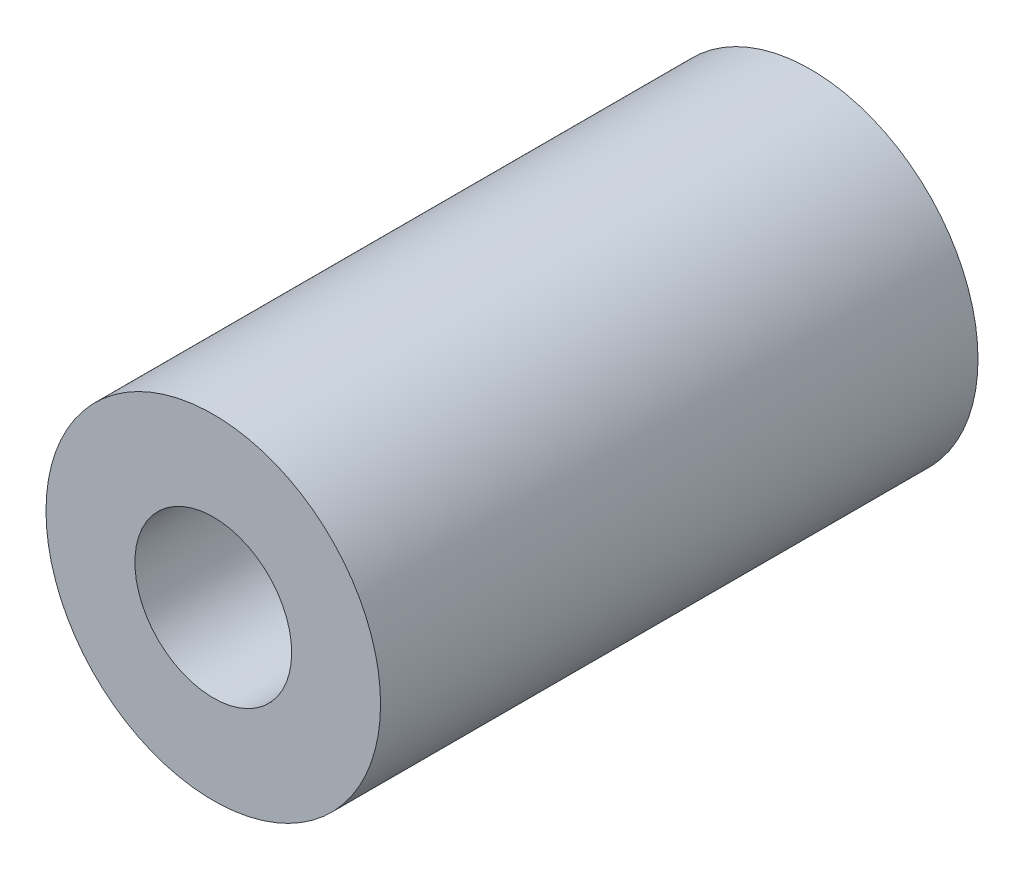
ISO-10303-21;
HEADER;
FILE_DESCRIPTION(('STEP AP214'),'2;1');
FILE_NAME('part.step','',(''),(''),'','','');
FILE_SCHEMA(('AUTOMOTIVE_DESIGN { 1 0 10303 214 1 1 1 1 }'));
ENDSEC;
DATA;
#1=APPLICATION_CONTEXT('core data for automotive mechanical design processes');
#2=APPLICATION_PROTOCOL_DEFINITION('international standard','automotive_design',2000,#1);
#3=PRODUCT_CONTEXT('',#1,'mechanical');
#4=PRODUCT('Part','Part','',(#3));
#5=PRODUCT_RELATED_PRODUCT_CATEGORY('part','',(#4));
#6=PRODUCT_DEFINITION_FORMATION('','',#4);
#7=PRODUCT_DEFINITION_CONTEXT('part definition',#1,'design');
#8=PRODUCT_DEFINITION('design','',#6,#7);
#9=PRODUCT_DEFINITION_SHAPE('','',#8);
#10=(LENGTH_UNIT() NAMED_UNIT(*) SI_UNIT(.MILLI.,.METRE.));
#11=(NAMED_UNIT(*) PLANE_ANGLE_UNIT() SI_UNIT($,.RADIAN.));
#12=(NAMED_UNIT(*) SI_UNIT($,.STERADIAN.) SOLID_ANGLE_UNIT());
#13=UNCERTAINTY_MEASURE_WITH_UNIT(LENGTH_MEASURE(1.E-05),#10,'distance_accuracy_value','');
#14=(GEOMETRIC_REPRESENTATION_CONTEXT(3) GLOBAL_UNCERTAINTY_ASSIGNED_CONTEXT((#13)) GLOBAL_UNIT_ASSIGNED_CONTEXT((#10,
#11,#12)) REPRESENTATION_CONTEXT('',''));
#15=CARTESIAN_POINT('',(0.,0.,0.));
#16=DIRECTION('',(0.,0.,1.));
#17=DIRECTION('',(1.,0.,0.));
#18=AXIS2_PLACEMENT_3D('',#15,#16,#17);
#19=CARTESIAN_POINT('',(0.,0.,19.05));
#20=DIRECTION('',(0.,0.,-1.));
#21=DIRECTION('',(-1.,0.,0.));
#22=AXIS2_PLACEMENT_3D('',#19,#20,#21);
#23=CYLINDRICAL_SURFACE('',#22,2.38125);
#24=CARTESIAN_POINT('',(0.,0.,0.));
#25=DIRECTION('',(0.,0.,1.));
#26=DIRECTION('',(1.,0.,0.));
#27=AXIS2_PLACEMENT_3D('',#24,#25,#26);
#28=CIRCLE('',#27,2.38125);
#29=CARTESIAN_POINT('',(2.38125,0.,0.));
#30=VERTEX_POINT('',#29);
#31=EDGE_CURVE('E54',#30,#30,#28,.T.);
#32=ORIENTED_EDGE('',*,*,#31,.F.);
#33=EDGE_LOOP('',(#32));
#34=FACE_BOUND('',#33,.T.);
#35=CARTESIAN_POINT('',(0.,0.,9.525));
#36=DIRECTION('',(0.,0.,1.));
#37=DIRECTION('',(1.,0.,0.));
#38=AXIS2_PLACEMENT_3D('',#35,#36,#37);
#39=CIRCLE('',#38,2.38125);
#40=CARTESIAN_POINT('',(2.38125,0.,9.525));
#41=VERTEX_POINT('',#40);
#42=EDGE_CURVE('E58',#41,#41,#39,.T.);
#43=ORIENTED_EDGE('',*,*,#42,.T.);
#44=EDGE_LOOP('',(#43));
#45=FACE_BOUND('',#44,.T.);
#46=ADVANCED_FACE('F41',(#34,#45),#23,.F.);
#47=CARTESIAN_POINT('',(0.,0.,19.05));
#48=DIRECTION('',(0.,0.,1.));
#49=DIRECTION('',(1.,0.,0.));
#50=AXIS2_PLACEMENT_3D('',#47,#48,#49);
#51=PLANE('',#50);
#52=CARTESIAN_POINT('',(0.,0.,19.05));
#53=DIRECTION('',(0.,0.,1.));
#54=DIRECTION('',(1.,0.,0.));
#55=AXIS2_PLACEMENT_3D('',#52,#53,#54);
#56=CIRCLE('',#55,2.5);
#57=CARTESIAN_POINT('',(2.5,0.,19.05));
#58=VERTEX_POINT('',#57);
#59=EDGE_CURVE('E45',#58,#58,#56,.T.);
#60=ORIENTED_EDGE('',*,*,#59,.F.);
#61=EDGE_LOOP('',(#60));
#62=FACE_BOUND('',#61,.T.);
#63=CARTESIAN_POINT('',(0.,0.,19.05));
#64=DIRECTION('',(0.,0.,1.));
#65=DIRECTION('',(1.,0.,0.));
#66=AXIS2_PLACEMENT_3D('',#63,#64,#65);
#67=CIRCLE('',#66,5.334);
#68=CARTESIAN_POINT('',(5.334,0.,19.05));
#69=VERTEX_POINT('',#68);
#70=EDGE_CURVE('E12',#69,#69,#67,.T.);
#71=ORIENTED_EDGE('',*,*,#70,.T.);
#72=EDGE_LOOP('',(#71));
#73=FACE_BOUND('',#72,.T.);
#74=ADVANCED_FACE('F83',(#62,#73),#51,.T.);
#75=CARTESIAN_POINT('',(0.,0.,0.));
#76=DIRECTION('',(0.,0.,1.));
#77=DIRECTION('',(1.,0.,0.));
#78=AXIS2_PLACEMENT_3D('',#75,#76,#77);
#79=PLANE('',#78);
#80=CARTESIAN_POINT('',(0.,0.,0.));
#81=DIRECTION('',(0.,0.,1.));
#82=DIRECTION('',(1.,0.,0.));
#83=AXIS2_PLACEMENT_3D('',#80,#81,#82);
#84=CIRCLE('',#83,5.334);
#85=CARTESIAN_POINT('',(5.334,0.,0.));
#86=VERTEX_POINT('',#85);
#87=EDGE_CURVE('E49',#86,#86,#84,.T.);
#88=ORIENTED_EDGE('',*,*,#87,.F.);
#89=EDGE_LOOP('',(#88));
#90=FACE_BOUND('',#89,.T.);
#91=ORIENTED_EDGE('',*,*,#31,.T.);
#92=EDGE_LOOP('',(#91));
#93=FACE_BOUND('',#92,.T.);
#94=ADVANCED_FACE('F79',(#90,#93),#79,.F.);
#95=CARTESIAN_POINT('',(0.,0.,19.05));
#96=DIRECTION('',(0.,0.,-1.));
#97=DIRECTION('',(-1.,0.,0.));
#98=AXIS2_PLACEMENT_3D('',#95,#96,#97);
#99=CYLINDRICAL_SURFACE('',#98,5.334);
#100=ORIENTED_EDGE('',*,*,#70,.F.);
#101=EDGE_LOOP('',(#100));
#102=FACE_BOUND('',#101,.T.);
#103=ORIENTED_EDGE('',*,*,#87,.T.);
#104=EDGE_LOOP('',(#103));
#105=FACE_BOUND('',#104,.T.);
#106=ADVANCED_FACE('F43',(#102,#105),#99,.T.);
#107=CARTESIAN_POINT('',(0.,0.,9.525));
#108=DIRECTION('',(0.,0.,1.));
#109=DIRECTION('',(1.,0.,0.));
#110=AXIS2_PLACEMENT_3D('',#107,#108,#109);
#111=CYLINDRICAL_SURFACE('',#110,2.5);
#112=ORIENTED_EDGE('',*,*,#59,.T.);
#113=EDGE_LOOP('',(#112));
#114=FACE_BOUND('',#113,.T.);
#115=CARTESIAN_POINT('',(0.,0.,9.525));
#116=DIRECTION('',(0.,0.,1.));
#117=DIRECTION('',(1.,0.,0.));
#118=AXIS2_PLACEMENT_3D('',#115,#116,#117);
#119=CIRCLE('',#118,2.5);
#120=CARTESIAN_POINT('',(2.5,0.,9.525));
#121=VERTEX_POINT('',#120);
#122=EDGE_CURVE('E60',#121,#121,#119,.T.);
#123=ORIENTED_EDGE('',*,*,#122,.F.);
#124=EDGE_LOOP('',(#123));
#125=FACE_BOUND('',#124,.T.);
#126=ADVANCED_FACE('F69',(#114,#125),#111,.F.);
#127=CARTESIAN_POINT('',(0.,0.,9.525));
#128=DIRECTION('',(0.,0.,1.));
#129=DIRECTION('',(1.,0.,0.));
#130=AXIS2_PLACEMENT_3D('',#127,#128,#129);
#131=PLANE('',#130);
#132=ORIENTED_EDGE('',*,*,#42,.F.);
#133=EDGE_LOOP('',(#132));
#134=FACE_BOUND('',#133,.T.);
#135=ORIENTED_EDGE('',*,*,#122,.T.);
#136=EDGE_LOOP('',(#135));
#137=FACE_BOUND('',#136,.T.);
#138=ADVANCED_FACE('F67',(#134,#137),#131,.T.);
#139=CLOSED_SHELL('',(#46,#74,#94,#106,#126,#138));
#140=MANIFOLD_SOLID_BREP('B2',#139);
#141=ADVANCED_BREP_SHAPE_REPRESENTATION('',(#18,#140),#14);
#142=SHAPE_DEFINITION_REPRESENTATION(#9,#141);
ENDSEC;
END-ISO-10303-21;
